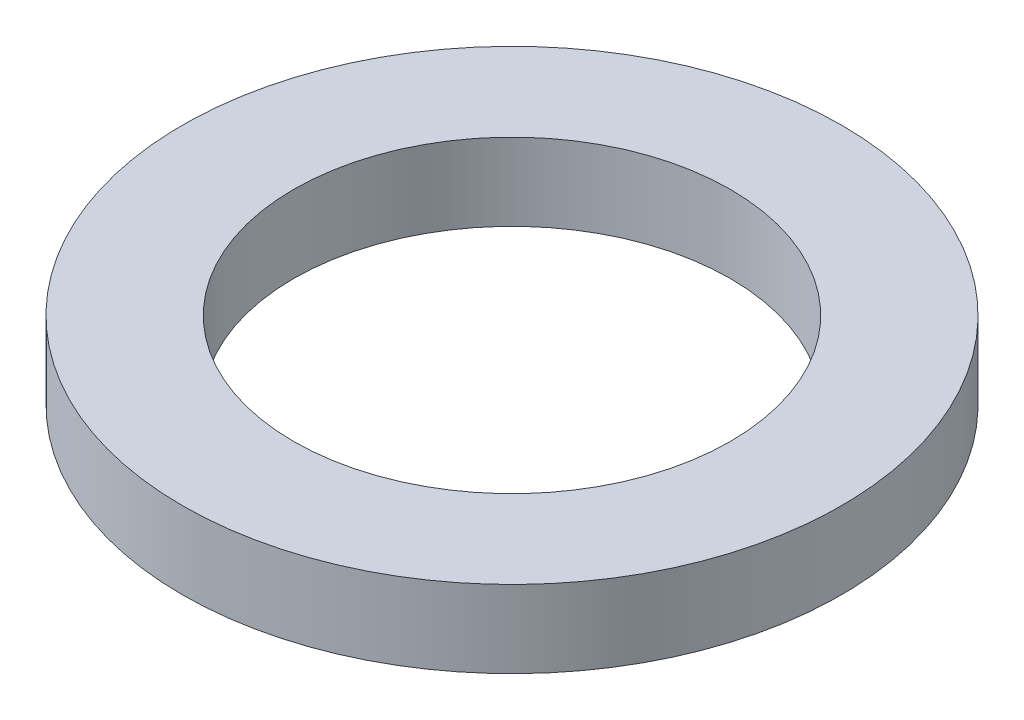
ISO-10303-21;
HEADER;
FILE_DESCRIPTION(('STEP AP214'),'2;1');
FILE_NAME('part.step','',(''),(''),'','','');
FILE_SCHEMA(('AUTOMOTIVE_DESIGN { 1 0 10303 214 1 1 1 1 }'));
ENDSEC;
DATA;
#1=APPLICATION_CONTEXT('core data for automotive mechanical design processes');
#2=APPLICATION_PROTOCOL_DEFINITION('international standard','automotive_design',2000,#1);
#3=PRODUCT_CONTEXT('',#1,'mechanical');
#4=PRODUCT('Part','Part','',(#3));
#5=PRODUCT_RELATED_PRODUCT_CATEGORY('part','',(#4));
#6=PRODUCT_DEFINITION_FORMATION('','',#4);
#7=PRODUCT_DEFINITION_CONTEXT('part definition',#1,'design');
#8=PRODUCT_DEFINITION('design','',#6,#7);
#9=PRODUCT_DEFINITION_SHAPE('','',#8);
#10=(LENGTH_UNIT() NAMED_UNIT(*) SI_UNIT(.MILLI.,.METRE.));
#11=(NAMED_UNIT(*) PLANE_ANGLE_UNIT() SI_UNIT($,.RADIAN.));
#12=(NAMED_UNIT(*) SI_UNIT($,.STERADIAN.) SOLID_ANGLE_UNIT());
#13=UNCERTAINTY_MEASURE_WITH_UNIT(LENGTH_MEASURE(1.E-05),#10,'distance_accuracy_value','');
#14=(GEOMETRIC_REPRESENTATION_CONTEXT(3) GLOBAL_UNCERTAINTY_ASSIGNED_CONTEXT((#13)) GLOBAL_UNIT_ASSIGNED_CONTEXT((#10,
#11,#12)) REPRESENTATION_CONTEXT('',''));
#15=CARTESIAN_POINT('',(0.,0.,0.));
#16=DIRECTION('',(0.,0.,1.));
#17=DIRECTION('',(1.,0.,0.));
#18=AXIS2_PLACEMENT_3D('',#15,#16,#17);
#19=CARTESIAN_POINT('',(0.,22.7096404931965,0.));
#20=DIRECTION('',(0.,1.,0.));
#21=DIRECTION('',(0.,0.,1.));
#22=AXIS2_PLACEMENT_3D('',#19,#20,#21);
#23=CYLINDRICAL_SURFACE('',#22,26.924);
#24=CARTESIAN_POINT('',(0.,-9.525,0.));
#25=DIRECTION('',(0.,1.,0.));
#26=DIRECTION('',(0.,0.,1.));
#27=AXIS2_PLACEMENT_3D('',#24,#25,#26);
#28=CIRCLE('',#27,26.924);
#29=CARTESIAN_POINT('',(0.,-9.525,26.924));
#30=VERTEX_POINT('',#29);
#31=EDGE_CURVE('E44',#30,#30,#28,.T.);
#32=ORIENTED_EDGE('',*,*,#31,.F.);
#33=EDGE_LOOP('',(#32));
#34=FACE_BOUND('',#33,.T.);
#35=CARTESIAN_POINT('',(0.,0.,0.));
#36=DIRECTION('',(0.,1.,0.));
#37=DIRECTION('',(0.,0.,1.));
#38=AXIS2_PLACEMENT_3D('',#35,#36,#37);
#39=CIRCLE('',#38,26.924);
#40=CARTESIAN_POINT('',(0.,0.,26.924));
#41=VERTEX_POINT('',#40);
#42=EDGE_CURVE('E10',#41,#41,#39,.T.);
#43=ORIENTED_EDGE('',*,*,#42,.T.);
#44=EDGE_LOOP('',(#43));
#45=FACE_BOUND('',#44,.T.);
#46=ADVANCED_FACE('F30',(#34,#45),#23,.F.);
#47=CARTESIAN_POINT('',(26.924,0.,0.));
#48=DIRECTION('',(0.,-1.,0.));
#49=DIRECTION('',(0.,0.,-1.));
#50=AXIS2_PLACEMENT_3D('',#47,#48,#49);
#51=PLANE('',#50);
#52=ORIENTED_EDGE('',*,*,#42,.F.);
#53=EDGE_LOOP('',(#52));
#54=FACE_BOUND('',#53,.T.);
#55=CARTESIAN_POINT('',(0.,0.,0.));
#56=DIRECTION('',(0.,1.,0.));
#57=DIRECTION('',(0.,0.,1.));
#58=AXIS2_PLACEMENT_3D('',#55,#56,#57);
#59=CIRCLE('',#58,40.64);
#60=CARTESIAN_POINT('',(0.,0.,40.64));
#61=VERTEX_POINT('',#60);
#62=EDGE_CURVE('E36',#61,#61,#59,.T.);
#63=ORIENTED_EDGE('',*,*,#62,.T.);
#64=EDGE_LOOP('',(#63));
#65=FACE_BOUND('',#64,.T.);
#66=ADVANCED_FACE('F53',(#54,#65),#51,.F.);
#67=CARTESIAN_POINT('',(0.,22.7096404931965,0.));
#68=DIRECTION('',(0.,1.,0.));
#69=DIRECTION('',(0.,0.,1.));
#70=AXIS2_PLACEMENT_3D('',#67,#68,#69);
#71=CYLINDRICAL_SURFACE('',#70,40.64);
#72=ORIENTED_EDGE('',*,*,#62,.F.);
#73=EDGE_LOOP('',(#72));
#74=FACE_BOUND('',#73,.T.);
#75=CARTESIAN_POINT('',(0.,-9.525,0.));
#76=DIRECTION('',(0.,1.,0.));
#77=DIRECTION('',(0.,0.,1.));
#78=AXIS2_PLACEMENT_3D('',#75,#76,#77);
#79=CIRCLE('',#78,40.64);
#80=CARTESIAN_POINT('',(0.,-9.525,40.64));
#81=VERTEX_POINT('',#80);
#82=EDGE_CURVE('E40',#81,#81,#79,.T.);
#83=ORIENTED_EDGE('',*,*,#82,.T.);
#84=EDGE_LOOP('',(#83));
#85=FACE_BOUND('',#84,.T.);
#86=ADVANCED_FACE('F57',(#74,#85),#71,.T.);
#87=CARTESIAN_POINT('',(26.924,-9.525,0.));
#88=DIRECTION('',(0.,1.,0.));
#89=DIRECTION('',(0.,0.,1.));
#90=AXIS2_PLACEMENT_3D('',#87,#88,#89);
#91=PLANE('',#90);
#92=ORIENTED_EDGE('',*,*,#82,.F.);
#93=EDGE_LOOP('',(#92));
#94=FACE_BOUND('',#93,.T.);
#95=ORIENTED_EDGE('',*,*,#31,.T.);
#96=EDGE_LOOP('',(#95));
#97=FACE_BOUND('',#96,.T.);
#98=ADVANCED_FACE('F50',(#94,#97),#91,.F.);
#99=CLOSED_SHELL('',(#46,#66,#86,#98));
#100=MANIFOLD_SOLID_BREP('B2',#99);
#101=ADVANCED_BREP_SHAPE_REPRESENTATION('',(#18,#100),#14);
#102=SHAPE_DEFINITION_REPRESENTATION(#9,#101);
ENDSEC;
END-ISO-10303-21;
